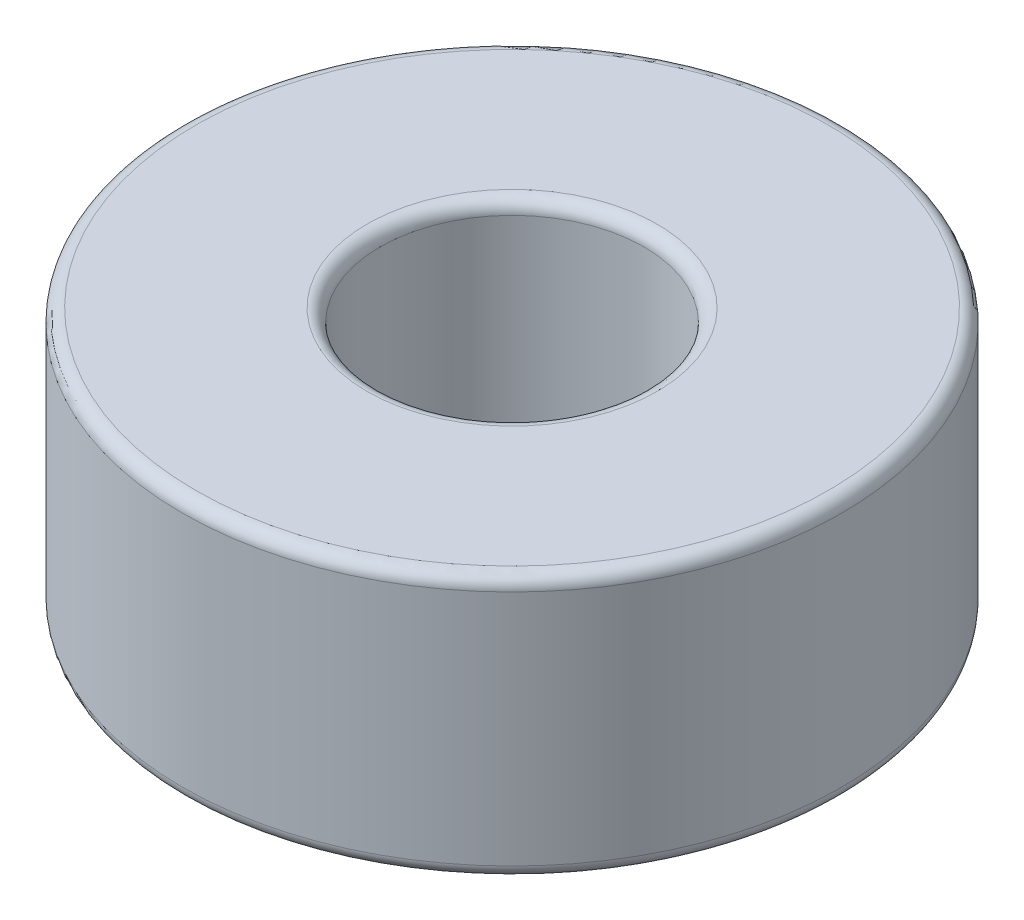
ISO-10303-21;
HEADER;
FILE_DESCRIPTION(('STEP AP214'),'2;1');
FILE_NAME('part.step','',(''),(''),'','','');
FILE_SCHEMA(('AUTOMOTIVE_DESIGN { 1 0 10303 214 1 1 1 1 }'));
ENDSEC;
DATA;
#1=APPLICATION_CONTEXT('core data for automotive mechanical design processes');
#2=APPLICATION_PROTOCOL_DEFINITION('international standard','automotive_design',2000,#1);
#3=PRODUCT_CONTEXT('',#1,'mechanical');
#4=PRODUCT('Part','Part','',(#3));
#5=PRODUCT_RELATED_PRODUCT_CATEGORY('part','',(#4));
#6=PRODUCT_DEFINITION_FORMATION('','',#4);
#7=PRODUCT_DEFINITION_CONTEXT('part definition',#1,'design');
#8=PRODUCT_DEFINITION('design','',#6,#7);
#9=PRODUCT_DEFINITION_SHAPE('','',#8);
#10=(LENGTH_UNIT() NAMED_UNIT(*) SI_UNIT(.MILLI.,.METRE.));
#11=(NAMED_UNIT(*) PLANE_ANGLE_UNIT() SI_UNIT($,.RADIAN.));
#12=(NAMED_UNIT(*) SI_UNIT($,.STERADIAN.) SOLID_ANGLE_UNIT());
#13=UNCERTAINTY_MEASURE_WITH_UNIT(LENGTH_MEASURE(1.E-05),#10,'distance_accuracy_value','');
#14=(GEOMETRIC_REPRESENTATION_CONTEXT(3) GLOBAL_UNCERTAINTY_ASSIGNED_CONTEXT((#13)) GLOBAL_UNIT_ASSIGNED_CONTEXT((#10,
#11,#12)) REPRESENTATION_CONTEXT('',''));
#15=CARTESIAN_POINT('',(0.,0.,0.));
#16=DIRECTION('',(0.,0.,1.));
#17=DIRECTION('',(1.,0.,0.));
#18=AXIS2_PLACEMENT_3D('',#15,#16,#17);
#19=CARTESIAN_POINT('',(0.,3.,0.));
#20=DIRECTION('',(0.,1.,0.));
#21=DIRECTION('',(0.,0.,1.));
#22=AXIS2_PLACEMENT_3D('',#19,#20,#21);
#23=PLANE('',#22);
#24=CARTESIAN_POINT('',(0.,3.,0.));
#25=DIRECTION('',(0.,1.,0.));
#26=DIRECTION('',(0.,0.,1.));
#27=AXIS2_PLACEMENT_3D('',#24,#25,#26);
#28=CIRCLE('',#27,7.2);
#29=CARTESIAN_POINT('',(0.,3.,7.2));
#30=VERTEX_POINT('',#29);
#31=EDGE_CURVE('E43',#30,#30,#28,.T.);
#32=ORIENTED_EDGE('',*,*,#31,.T.);
#33=EDGE_LOOP('',(#32));
#34=FACE_BOUND('',#33,.T.);
#35=CARTESIAN_POINT('',(0.,3.,0.));
#36=DIRECTION('',(0.,1.,0.));
#37=DIRECTION('',(0.,0.,1.));
#38=AXIS2_PLACEMENT_3D('',#35,#36,#37);
#39=CIRCLE('',#38,3.3);
#40=CARTESIAN_POINT('',(0.,3.,3.3));
#41=VERTEX_POINT('',#40);
#42=EDGE_CURVE('E47',#41,#41,#39,.F.);
#43=ORIENTED_EDGE('',*,*,#42,.T.);
#44=EDGE_LOOP('',(#43));
#45=FACE_BOUND('',#44,.T.);
#46=ADVANCED_FACE('F32',(#34,#45),#23,.T.);
#47=CARTESIAN_POINT('',(0.,-3.,0.));
#48=DIRECTION('',(0.,1.,0.));
#49=DIRECTION('',(0.,0.,1.));
#50=AXIS2_PLACEMENT_3D('',#47,#48,#49);
#51=PLANE('',#50);
#52=CARTESIAN_POINT('',(0.,-3.,0.));
#53=DIRECTION('',(0.,1.,0.));
#54=DIRECTION('',(0.,0.,1.));
#55=AXIS2_PLACEMENT_3D('',#52,#53,#54);
#56=CIRCLE('',#55,7.2);
#57=CARTESIAN_POINT('',(0.,-3.,7.2));
#58=VERTEX_POINT('',#57);
#59=EDGE_CURVE('E52',#58,#58,#56,.F.);
#60=ORIENTED_EDGE('',*,*,#59,.T.);
#61=EDGE_LOOP('',(#60));
#62=FACE_BOUND('',#61,.T.);
#63=CARTESIAN_POINT('',(0.,-3.,0.));
#64=DIRECTION('',(0.,1.,0.));
#65=DIRECTION('',(0.,0.,1.));
#66=AXIS2_PLACEMENT_3D('',#63,#64,#65);
#67=CIRCLE('',#66,3.3);
#68=CARTESIAN_POINT('',(0.,-3.,3.3));
#69=VERTEX_POINT('',#68);
#70=EDGE_CURVE('E55',#69,#69,#67,.T.);
#71=ORIENTED_EDGE('',*,*,#70,.T.);
#72=EDGE_LOOP('',(#71));
#73=FACE_BOUND('',#72,.T.);
#74=ADVANCED_FACE('F77',(#62,#73),#51,.F.);
#75=CARTESIAN_POINT('',(0.,3.,0.));
#76=DIRECTION('',(0.,-1.,0.));
#77=DIRECTION('',(0.,0.,-1.));
#78=AXIS2_PLACEMENT_3D('',#75,#76,#77);
#79=CYLINDRICAL_SURFACE('',#78,7.5);
#80=CARTESIAN_POINT('',(0.,-2.7,0.));
#81=DIRECTION('',(0.,1.,0.));
#82=DIRECTION('',(0.,0.,1.));
#83=AXIS2_PLACEMENT_3D('',#80,#81,#82);
#84=CIRCLE('',#83,7.5);
#85=CARTESIAN_POINT('',(0.,-2.7,7.5));
#86=VERTEX_POINT('',#85);
#87=EDGE_CURVE('E58',#86,#86,#84,.T.);
#88=ORIENTED_EDGE('',*,*,#87,.T.);
#89=EDGE_LOOP('',(#88));
#90=FACE_BOUND('',#89,.T.);
#91=CARTESIAN_POINT('',(0.,2.7,0.));
#92=DIRECTION('',(0.,1.,0.));
#93=DIRECTION('',(0.,0.,1.));
#94=AXIS2_PLACEMENT_3D('',#91,#92,#93);
#95=CIRCLE('',#94,7.5);
#96=CARTESIAN_POINT('',(0.,2.7,7.5));
#97=VERTEX_POINT('',#96);
#98=EDGE_CURVE('E61',#97,#97,#95,.F.);
#99=ORIENTED_EDGE('',*,*,#98,.T.);
#100=EDGE_LOOP('',(#99));
#101=FACE_BOUND('',#100,.T.);
#102=ADVANCED_FACE('F65',(#90,#101),#79,.T.);
#103=CARTESIAN_POINT('',(0.,3.,0.));
#104=DIRECTION('',(0.,-1.,0.));
#105=DIRECTION('',(0.,0.,-1.));
#106=AXIS2_PLACEMENT_3D('',#103,#104,#105);
#107=CYLINDRICAL_SURFACE('',#106,3.);
#108=CARTESIAN_POINT('',(0.,-2.7,0.));
#109=DIRECTION('',(0.,1.,0.));
#110=DIRECTION('',(0.,0.,1.));
#111=AXIS2_PLACEMENT_3D('',#108,#109,#110);
#112=CIRCLE('',#111,3.);
#113=CARTESIAN_POINT('',(0.,-2.7,3.));
#114=VERTEX_POINT('',#113);
#115=EDGE_CURVE('E10',#114,#114,#112,.F.);
#116=ORIENTED_EDGE('',*,*,#115,.T.);
#117=EDGE_LOOP('',(#116));
#118=FACE_BOUND('',#117,.T.);
#119=CARTESIAN_POINT('',(0.,2.7,0.));
#120=DIRECTION('',(0.,1.,0.));
#121=DIRECTION('',(0.,0.,1.));
#122=AXIS2_PLACEMENT_3D('',#119,#120,#121);
#123=CIRCLE('',#122,3.);
#124=CARTESIAN_POINT('',(0.,2.7,3.));
#125=VERTEX_POINT('',#124);
#126=EDGE_CURVE('E39',#125,#125,#123,.T.);
#127=ORIENTED_EDGE('',*,*,#126,.T.);
#128=EDGE_LOOP('',(#127));
#129=FACE_BOUND('',#128,.T.);
#130=ADVANCED_FACE('F93',(#118,#129),#107,.F.);
#131=CARTESIAN_POINT('',(0.,-2.7,0.));
#132=DIRECTION('',(0.,1.,0.));
#133=DIRECTION('',(0.,0.,1.));
#134=AXIS2_PLACEMENT_3D('',#131,#132,#133);
#135=TOROIDAL_SURFACE('',#134,7.2,0.3);
#136=ORIENTED_EDGE('',*,*,#59,.F.);
#137=EDGE_LOOP('',(#136));
#138=FACE_BOUND('',#137,.T.);
#139=ORIENTED_EDGE('',*,*,#87,.F.);
#140=EDGE_LOOP('',(#139));
#141=FACE_BOUND('',#140,.T.);
#142=ADVANCED_FACE('F71',(#138,#141),#135,.T.);
#143=CARTESIAN_POINT('',(0.,2.7,0.));
#144=DIRECTION('',(0.,1.,0.));
#145=DIRECTION('',(0.,0.,1.));
#146=AXIS2_PLACEMENT_3D('',#143,#144,#145);
#147=TOROIDAL_SURFACE('',#146,7.2,0.3);
#148=ORIENTED_EDGE('',*,*,#98,.F.);
#149=EDGE_LOOP('',(#148));
#150=FACE_BOUND('',#149,.T.);
#151=ORIENTED_EDGE('',*,*,#31,.F.);
#152=EDGE_LOOP('',(#151));
#153=FACE_BOUND('',#152,.T.);
#154=ADVANCED_FACE('F67',(#150,#153),#147,.T.);
#155=CARTESIAN_POINT('',(0.,-2.7,0.));
#156=DIRECTION('',(0.,1.,0.));
#157=DIRECTION('',(0.,0.,1.));
#158=AXIS2_PLACEMENT_3D('',#155,#156,#157);
#159=TOROIDAL_SURFACE('',#158,3.3,0.3);
#160=ORIENTED_EDGE('',*,*,#115,.F.);
#161=EDGE_LOOP('',(#160));
#162=FACE_BOUND('',#161,.T.);
#163=ORIENTED_EDGE('',*,*,#70,.F.);
#164=EDGE_LOOP('',(#163));
#165=FACE_BOUND('',#164,.T.);
#166=ADVANCED_FACE('F70',(#162,#165),#159,.T.);
#167=CARTESIAN_POINT('',(0.,2.7,0.));
#168=DIRECTION('',(0.,1.,0.));
#169=DIRECTION('',(0.,0.,1.));
#170=AXIS2_PLACEMENT_3D('',#167,#168,#169);
#171=TOROIDAL_SURFACE('',#170,3.3,0.3);
#172=ORIENTED_EDGE('',*,*,#42,.F.);
#173=EDGE_LOOP('',(#172));
#174=FACE_BOUND('',#173,.T.);
#175=ORIENTED_EDGE('',*,*,#126,.F.);
#176=EDGE_LOOP('',(#175));
#177=FACE_BOUND('',#176,.T.);
#178=ADVANCED_FACE('F34',(#174,#177),#171,.T.);
#179=CLOSED_SHELL('',(#46,#74,#102,#130,#142,#154,#166,#178));
#180=MANIFOLD_SOLID_BREP('B2',#179);
#181=ADVANCED_BREP_SHAPE_REPRESENTATION('',(#18,#180),#14);
#182=SHAPE_DEFINITION_REPRESENTATION(#9,#181);
ENDSEC;
END-ISO-10303-21;
